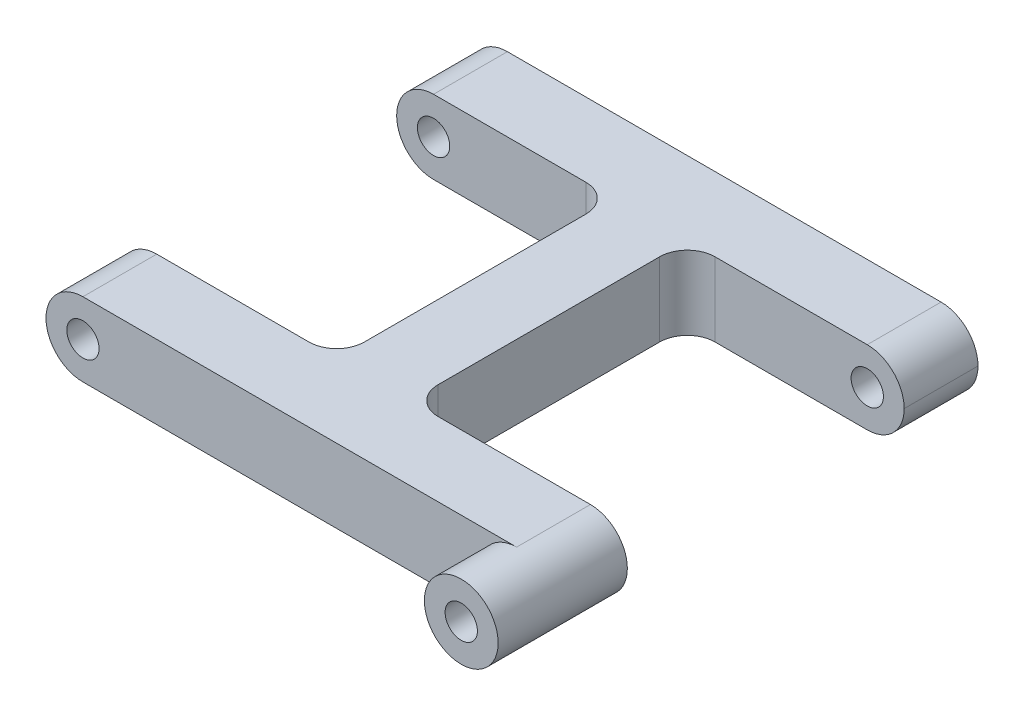
ISO-10303-21;
HEADER;
FILE_DESCRIPTION(('STEP AP214'),'2;1');
FILE_NAME('part.step','',(''),(''),'','','');
FILE_SCHEMA(('AUTOMOTIVE_DESIGN { 1 0 10303 214 1 1 1 1 }'));
ENDSEC;
DATA;
#1=APPLICATION_CONTEXT('core data for automotive mechanical design processes');
#2=APPLICATION_PROTOCOL_DEFINITION('international standard','automotive_design',2000,#1);
#3=PRODUCT_CONTEXT('',#1,'mechanical');
#4=PRODUCT('Part','Part','',(#3));
#5=PRODUCT_RELATED_PRODUCT_CATEGORY('part','',(#4));
#6=PRODUCT_DEFINITION_FORMATION('','',#4);
#7=PRODUCT_DEFINITION_CONTEXT('part definition',#1,'design');
#8=PRODUCT_DEFINITION('design','',#6,#7);
#9=PRODUCT_DEFINITION_SHAPE('','',#8);
#10=(LENGTH_UNIT() NAMED_UNIT(*) SI_UNIT(.MILLI.,.METRE.));
#11=(NAMED_UNIT(*) PLANE_ANGLE_UNIT() SI_UNIT($,.RADIAN.));
#12=(NAMED_UNIT(*) SI_UNIT($,.STERADIAN.) SOLID_ANGLE_UNIT());
#13=UNCERTAINTY_MEASURE_WITH_UNIT(LENGTH_MEASURE(1.E-05),#10,'distance_accuracy_value','');
#14=(GEOMETRIC_REPRESENTATION_CONTEXT(3) GLOBAL_UNCERTAINTY_ASSIGNED_CONTEXT((#13)) GLOBAL_UNIT_ASSIGNED_CONTEXT((#10,
#11,#12)) REPRESENTATION_CONTEXT('',''));
#15=CARTESIAN_POINT('',(0.,0.,0.));
#16=DIRECTION('',(0.,0.,1.));
#17=DIRECTION('',(1.,0.,0.));
#18=AXIS2_PLACEMENT_3D('',#15,#16,#17);
#19=CARTESIAN_POINT('',(23.5,0.,-23.));
#20=DIRECTION('',(0.,0.,1.));
#21=DIRECTION('',(1.,0.,0.));
#22=AXIS2_PLACEMENT_3D('',#19,#20,#21);
#23=CYLINDRICAL_SURFACE('',#22,1.75);
#24=CARTESIAN_POINT('',(23.5,0.,-15.));
#25=DIRECTION('',(0.,0.,-1.));
#26=DIRECTION('',(-1.,0.,0.));
#27=AXIS2_PLACEMENT_3D('',#24,#25,#26);
#28=CIRCLE('',#27,1.75);
#29=CARTESIAN_POINT('',(21.75,0.,-15.));
#30=VERTEX_POINT('',#29);
#31=EDGE_CURVE('E368',#30,#30,#28,.T.);
#32=ORIENTED_EDGE('',*,*,#31,.F.);
#33=EDGE_LOOP('',(#32));
#34=FACE_BOUND('',#33,.T.);
#35=CARTESIAN_POINT('',(23.5,0.,-19.8));
#36=DIRECTION('',(0.,0.,-1.));
#37=DIRECTION('',(-1.,0.,0.));
#38=AXIS2_PLACEMENT_3D('',#35,#36,#37);
#39=CIRCLE('',#38,1.75);
#40=CARTESIAN_POINT('',(21.75,0.,-19.8));
#41=VERTEX_POINT('',#40);
#42=EDGE_CURVE('E41',#41,#41,#39,.F.);
#43=ORIENTED_EDGE('',*,*,#42,.F.);
#44=EDGE_LOOP('',(#43));
#45=FACE_BOUND('',#44,.T.);
#46=ADVANCED_FACE('F37',(#34,#45),#23,.F.);
#47=CARTESIAN_POINT('',(27.5,4.,23.));
#48=DIRECTION('',(0.,0.,-1.));
#49=DIRECTION('',(-1.,0.,0.));
#50=AXIS2_PLACEMENT_3D('',#47,#48,#49);
#51=PLANE('',#50);
#52=CARTESIAN_POINT('',(-23.5,1.3965925355343E-13,23.));
#53=DIRECTION('',(0.,0.,1.));
#54=DIRECTION('',(1.,0.,0.));
#55=AXIS2_PLACEMENT_3D('',#52,#53,#54);
#56=CIRCLE('',#55,1.74999999999996);
#57=CARTESIAN_POINT('',(-21.75,1.3965925355343E-13,23.));
#58=VERTEX_POINT('',#57);
#59=EDGE_CURVE('E377',#58,#58,#56,.T.);
#60=ORIENTED_EDGE('',*,*,#59,.F.);
#61=EDGE_LOOP('',(#60));
#62=FACE_BOUND('',#61,.T.);
#63=CARTESIAN_POINT('',(23.5,0.,23.));
#64=DIRECTION('',(0.,0.,1.));
#65=DIRECTION('',(1.,0.,0.));
#66=AXIS2_PLACEMENT_3D('',#63,#64,#65);
#67=CIRCLE('',#66,4.);
#68=CARTESIAN_POINT('',(23.5,4.,23.));
#69=VERTEX_POINT('',#68);
#70=CARTESIAN_POINT('',(23.5,-4.,23.));
#71=VERTEX_POINT('',#70);
#72=EDGE_CURVE('E11',#69,#71,#67,.T.);
#73=ORIENTED_EDGE('',*,*,#72,.F.);
#74=DIRECTION('',(1.,0.,0.));
#75=VECTOR('',#74,1.);
#76=CARTESIAN_POINT('',(27.5,4.,23.));
#77=LINE('',#76,#75);
#78=CARTESIAN_POINT('',(-23.5,4.,23.));
#79=VERTEX_POINT('',#78);
#80=EDGE_CURVE('E354',#79,#69,#77,.T.);
#81=ORIENTED_EDGE('',*,*,#80,.F.);
#82=CARTESIAN_POINT('',(-23.5,0.,23.));
#83=DIRECTION('',(0.,0.,-1.));
#84=DIRECTION('',(-1.,0.,0.));
#85=AXIS2_PLACEMENT_3D('',#82,#83,#84);
#86=CIRCLE('',#85,4.);
#87=CARTESIAN_POINT('',(-27.5,0.,23.));
#88=VERTEX_POINT('',#87);
#89=EDGE_CURVE('E307',#79,#88,#86,.F.);
#90=ORIENTED_EDGE('',*,*,#89,.T.);
#91=CARTESIAN_POINT('',(-23.5,0.,23.));
#92=DIRECTION('',(0.,0.,-1.));
#93=DIRECTION('',(-1.,0.,0.));
#94=AXIS2_PLACEMENT_3D('',#91,#92,#93);
#95=CIRCLE('',#94,4.);
#96=CARTESIAN_POINT('',(-23.5,-4.,23.));
#97=VERTEX_POINT('',#96);
#98=EDGE_CURVE('E309',#88,#97,#95,.F.);
#99=ORIENTED_EDGE('',*,*,#98,.T.);
#100=DIRECTION('',(1.,0.,0.));
#101=VECTOR('',#100,1.);
#102=CARTESIAN_POINT('',(27.5,-4.,23.));
#103=LINE('',#102,#101);
#104=EDGE_CURVE('E268',#97,#71,#103,.T.);
#105=ORIENTED_EDGE('',*,*,#104,.T.);
#106=EDGE_LOOP('',(#73,#81,#90,#99,#105));
#107=FACE_BOUND('',#106,.T.);
#108=ADVANCED_FACE('F347',(#62,#107),#51,.F.);
#109=CARTESIAN_POINT('',(-4.,4.,-15.));
#110=DIRECTION('',(0.,0.,-1.));
#111=DIRECTION('',(-1.,0.,0.));
#112=AXIS2_PLACEMENT_3D('',#109,#110,#111);
#113=PLANE('',#112);
#114=CARTESIAN_POINT('',(-23.5,1.3965925355343E-13,-15.));
#115=DIRECTION('',(0.,0.,-1.));
#116=DIRECTION('',(-1.,0.,0.));
#117=AXIS2_PLACEMENT_3D('',#114,#115,#116);
#118=CIRCLE('',#117,1.74999999999996);
#119=CARTESIAN_POINT('',(-25.25,1.3965925355343E-13,-15.));
#120=VERTEX_POINT('',#119);
#121=EDGE_CURVE('E371',#120,#120,#118,.T.);
#122=ORIENTED_EDGE('',*,*,#121,.T.);
#123=EDGE_LOOP('',(#122));
#124=FACE_BOUND('',#123,.T.);
#125=DIRECTION('',(1.,0.,0.));
#126=VECTOR('',#125,1.);
#127=CARTESIAN_POINT('',(-4.,-4.,-15.));
#128=LINE('',#127,#126);
#129=CARTESIAN_POINT('',(-23.5,-4.,-15.));
#130=VERTEX_POINT('',#129);
#131=CARTESIAN_POINT('',(-7.,-4.,-15.));
#132=VERTEX_POINT('',#131);
#133=EDGE_CURVE('E259',#130,#132,#128,.T.);
#134=ORIENTED_EDGE('',*,*,#133,.T.);
#135=DIRECTION('',(0.,-1.,0.));
#136=VECTOR('',#135,1.);
#137=CARTESIAN_POINT('',(-7.,4.,-15.));
#138=LINE('',#137,#136);
#139=CARTESIAN_POINT('',(-7.,4.,-15.));
#140=VERTEX_POINT('',#139);
#141=EDGE_CURVE('E203',#132,#140,#138,.F.);
#142=ORIENTED_EDGE('',*,*,#141,.T.);
#143=DIRECTION('',(1.,0.,0.));
#144=VECTOR('',#143,1.);
#145=CARTESIAN_POINT('',(-4.,4.,-15.));
#146=LINE('',#145,#144);
#147=CARTESIAN_POINT('',(-23.5,4.,-15.));
#148=VERTEX_POINT('',#147);
#149=EDGE_CURVE('E277',#148,#140,#146,.T.);
#150=ORIENTED_EDGE('',*,*,#149,.F.);
#151=CARTESIAN_POINT('',(-23.5,0.,-15.));
#152=DIRECTION('',(0.,0.,-1.));
#153=DIRECTION('',(-1.,0.,0.));
#154=AXIS2_PLACEMENT_3D('',#151,#152,#153);
#155=CIRCLE('',#154,4.);
#156=CARTESIAN_POINT('',(-27.5,0.,-15.));
#157=VERTEX_POINT('',#156);
#158=EDGE_CURVE('E253',#148,#157,#155,.F.);
#159=ORIENTED_EDGE('',*,*,#158,.T.);
#160=CARTESIAN_POINT('',(-23.5,0.,-15.));
#161=DIRECTION('',(0.,0.,-1.));
#162=DIRECTION('',(-1.,0.,0.));
#163=AXIS2_PLACEMENT_3D('',#160,#161,#162);
#164=CIRCLE('',#163,4.);
#165=EDGE_CURVE('E279',#157,#130,#164,.F.);
#166=ORIENTED_EDGE('',*,*,#165,.T.);
#167=EDGE_LOOP('',(#134,#142,#150,#159,#166));
#168=FACE_BOUND('',#167,.T.);
#169=ADVANCED_FACE('F405',(#124,#168),#113,.F.);
#170=CARTESIAN_POINT('',(-4.,4.,15.));
#171=DIRECTION('',(1.,0.,0.));
#172=DIRECTION('',(0.,0.,-1.));
#173=AXIS2_PLACEMENT_3D('',#170,#171,#172);
#174=PLANE('',#173);
#175=DIRECTION('',(0.,0.,1.));
#176=VECTOR('',#175,1.);
#177=CARTESIAN_POINT('',(-4.,-4.,15.));
#178=LINE('',#177,#176);
#179=CARTESIAN_POINT('',(-4.,-4.,-12.));
#180=VERTEX_POINT('',#179);
#181=CARTESIAN_POINT('',(-4.,-4.,12.));
#182=VERTEX_POINT('',#181);
#183=EDGE_CURVE('E262',#180,#182,#178,.T.);
#184=ORIENTED_EDGE('',*,*,#183,.T.);
#185=DIRECTION('',(0.,-1.,0.));
#186=VECTOR('',#185,1.);
#187=CARTESIAN_POINT('',(-4.,4.,12.));
#188=LINE('',#187,#186);
#189=CARTESIAN_POINT('',(-4.,4.,12.));
#190=VERTEX_POINT('',#189);
#191=EDGE_CURVE('E201',#182,#190,#188,.F.);
#192=ORIENTED_EDGE('',*,*,#191,.T.);
#193=DIRECTION('',(0.,0.,1.));
#194=VECTOR('',#193,1.);
#195=CARTESIAN_POINT('',(-4.,4.,15.));
#196=LINE('',#195,#194);
#197=CARTESIAN_POINT('',(-4.,4.,-12.));
#198=VERTEX_POINT('',#197);
#199=EDGE_CURVE('E361',#198,#190,#196,.T.);
#200=ORIENTED_EDGE('',*,*,#199,.F.);
#201=DIRECTION('',(0.,-1.,0.));
#202=VECTOR('',#201,1.);
#203=CARTESIAN_POINT('',(-4.,-4.,-12.));
#204=LINE('',#203,#202);
#205=EDGE_CURVE('E198',#198,#180,#204,.T.);
#206=ORIENTED_EDGE('',*,*,#205,.T.);
#207=EDGE_LOOP('',(#184,#192,#200,#206));
#208=FACE_BOUND('',#207,.T.);
#209=ADVANCED_FACE('F477',(#208),#174,.F.);
#210=CARTESIAN_POINT('',(-27.5,4.,15.));
#211=DIRECTION('',(0.,0.,1.));
#212=DIRECTION('',(1.,0.,0.));
#213=AXIS2_PLACEMENT_3D('',#210,#211,#212);
#214=PLANE('',#213);
#215=CARTESIAN_POINT('',(-23.5,1.3965925355343E-13,15.));
#216=DIRECTION('',(0.,0.,1.));
#217=DIRECTION('',(1.,0.,0.));
#218=AXIS2_PLACEMENT_3D('',#215,#216,#217);
#219=CIRCLE('',#218,1.74999999999996);
#220=CARTESIAN_POINT('',(-21.75,1.3965925355343E-13,15.));
#221=VERTEX_POINT('',#220);
#222=EDGE_CURVE('E374',#221,#221,#219,.T.);
#223=ORIENTED_EDGE('',*,*,#222,.T.);
#224=EDGE_LOOP('',(#223));
#225=FACE_BOUND('',#224,.T.);
#226=DIRECTION('',(-1.,0.,0.));
#227=VECTOR('',#226,1.);
#228=CARTESIAN_POINT('',(-27.5,4.,15.));
#229=LINE('',#228,#227);
#230=CARTESIAN_POINT('',(-7.,4.,15.));
#231=VERTEX_POINT('',#230);
#232=CARTESIAN_POINT('',(-23.5,4.,15.));
#233=VERTEX_POINT('',#232);
#234=EDGE_CURVE('E340',#231,#233,#229,.T.);
#235=ORIENTED_EDGE('',*,*,#234,.F.);
#236=DIRECTION('',(0.,-1.,0.));
#237=VECTOR('',#236,1.);
#238=CARTESIAN_POINT('',(-7.,-4.,15.));
#239=LINE('',#238,#237);
#240=CARTESIAN_POINT('',(-7.,-4.,15.));
#241=VERTEX_POINT('',#240);
#242=EDGE_CURVE('E195',#231,#241,#239,.T.);
#243=ORIENTED_EDGE('',*,*,#242,.T.);
#244=DIRECTION('',(-1.,0.,0.));
#245=VECTOR('',#244,1.);
#246=CARTESIAN_POINT('',(-27.5,-4.,15.));
#247=LINE('',#246,#245);
#248=CARTESIAN_POINT('',(-23.5,-4.,15.));
#249=VERTEX_POINT('',#248);
#250=EDGE_CURVE('E266',#241,#249,#247,.T.);
#251=ORIENTED_EDGE('',*,*,#250,.T.);
#252=CARTESIAN_POINT('',(-23.5,0.,15.));
#253=DIRECTION('',(0.,0.,1.));
#254=DIRECTION('',(1.,0.,0.));
#255=AXIS2_PLACEMENT_3D('',#252,#253,#254);
#256=CIRCLE('',#255,4.);
#257=CARTESIAN_POINT('',(-27.5,0.,15.));
#258=VERTEX_POINT('',#257);
#259=EDGE_CURVE('E314',#249,#258,#256,.F.);
#260=ORIENTED_EDGE('',*,*,#259,.T.);
#261=CARTESIAN_POINT('',(-23.5,0.,15.));
#262=DIRECTION('',(0.,0.,1.));
#263=DIRECTION('',(1.,0.,0.));
#264=AXIS2_PLACEMENT_3D('',#261,#262,#263);
#265=CIRCLE('',#264,4.);
#266=EDGE_CURVE('E311',#258,#233,#265,.F.);
#267=ORIENTED_EDGE('',*,*,#266,.T.);
#268=EDGE_LOOP('',(#235,#243,#251,#260,#267));
#269=FACE_BOUND('',#268,.T.);
#270=ADVANCED_FACE('F339',(#225,#269),#214,.F.);
#271=CARTESIAN_POINT('',(27.5,4.,15.));
#272=DIRECTION('',(0.,0.,1.));
#273=DIRECTION('',(1.,0.,0.));
#274=AXIS2_PLACEMENT_3D('',#271,#272,#273);
#275=PLANE('',#274);
#276=CARTESIAN_POINT('',(23.5,0.,15.));
#277=DIRECTION('',(0.,0.,1.));
#278=DIRECTION('',(1.,0.,0.));
#279=AXIS2_PLACEMENT_3D('',#276,#277,#278);
#280=CIRCLE('',#279,1.75);
#281=CARTESIAN_POINT('',(25.25,0.,15.));
#282=VERTEX_POINT('',#281);
#283=EDGE_CURVE('E263',#282,#282,#280,.T.);
#284=ORIENTED_EDGE('',*,*,#283,.T.);
#285=EDGE_LOOP('',(#284));
#286=FACE_BOUND('',#285,.T.);
#287=DIRECTION('',(-1.,0.,0.));
#288=VECTOR('',#287,1.);
#289=CARTESIAN_POINT('',(27.5,-4.,15.));
#290=LINE('',#289,#288);
#291=CARTESIAN_POINT('',(23.5,-4.,15.));
#292=VERTEX_POINT('',#291);
#293=CARTESIAN_POINT('',(7.00000000000001,-4.,15.));
#294=VERTEX_POINT('',#293);
#295=EDGE_CURVE('E239',#292,#294,#290,.T.);
#296=ORIENTED_EDGE('',*,*,#295,.T.);
#297=DIRECTION('',(0.,-1.,0.));
#298=VECTOR('',#297,1.);
#299=CARTESIAN_POINT('',(7.,4.,15.));
#300=LINE('',#299,#298);
#301=CARTESIAN_POINT('',(7.00000000000001,4.,15.));
#302=VERTEX_POINT('',#301);
#303=EDGE_CURVE('E210',#294,#302,#300,.F.);
#304=ORIENTED_EDGE('',*,*,#303,.T.);
#305=DIRECTION('',(-1.,0.,0.));
#306=VECTOR('',#305,1.);
#307=CARTESIAN_POINT('',(27.5,4.,15.));
#308=LINE('',#307,#306);
#309=CARTESIAN_POINT('',(23.5,4.,15.));
#310=VERTEX_POINT('',#309);
#311=EDGE_CURVE('E255',#310,#302,#308,.T.);
#312=ORIENTED_EDGE('',*,*,#311,.F.);
#313=CARTESIAN_POINT('',(23.5,0.,15.));
#314=DIRECTION('',(0.,0.,1.));
#315=DIRECTION('',(1.,0.,0.));
#316=AXIS2_PLACEMENT_3D('',#313,#314,#315);
#317=CIRCLE('',#316,4.);
#318=CARTESIAN_POINT('',(27.5,0.,15.));
#319=VERTEX_POINT('',#318);
#320=EDGE_CURVE('E319',#310,#319,#317,.F.);
#321=ORIENTED_EDGE('',*,*,#320,.T.);
#322=CARTESIAN_POINT('',(23.5,0.,15.));
#323=DIRECTION('',(0.,0.,1.));
#324=DIRECTION('',(1.,0.,0.));
#325=AXIS2_PLACEMENT_3D('',#322,#323,#324);
#326=CIRCLE('',#325,4.);
#327=EDGE_CURVE('E183',#319,#292,#326,.F.);
#328=ORIENTED_EDGE('',*,*,#327,.T.);
#329=EDGE_LOOP('',(#296,#304,#312,#321,#328));
#330=FACE_BOUND('',#329,.T.);
#331=ADVANCED_FACE('F356',(#286,#330),#275,.F.);
#332=CARTESIAN_POINT('',(4.,4.,15.));
#333=DIRECTION('',(-1.,0.,0.));
#334=DIRECTION('',(0.,0.,1.));
#335=AXIS2_PLACEMENT_3D('',#332,#333,#334);
#336=PLANE('',#335);
#337=DIRECTION('',(0.,0.,-1.));
#338=VECTOR('',#337,1.);
#339=CARTESIAN_POINT('',(4.,4.,15.));
#340=LINE('',#339,#338);
#341=CARTESIAN_POINT('',(4.,4.,12.));
#342=VERTEX_POINT('',#341);
#343=CARTESIAN_POINT('',(4.,4.,-12.));
#344=VERTEX_POINT('',#343);
#345=EDGE_CURVE('E250',#342,#344,#340,.T.);
#346=ORIENTED_EDGE('',*,*,#345,.F.);
#347=DIRECTION('',(0.,-1.,0.));
#348=VECTOR('',#347,1.);
#349=CARTESIAN_POINT('',(4.,-4.,12.));
#350=LINE('',#349,#348);
#351=CARTESIAN_POINT('',(4.,-4.,12.));
#352=VERTEX_POINT('',#351);
#353=EDGE_CURVE('E207',#342,#352,#350,.T.);
#354=ORIENTED_EDGE('',*,*,#353,.T.);
#355=DIRECTION('',(0.,0.,-1.));
#356=VECTOR('',#355,1.);
#357=CARTESIAN_POINT('',(4.,-4.,15.));
#358=LINE('',#357,#356);
#359=CARTESIAN_POINT('',(4.,-4.,-12.));
#360=VERTEX_POINT('',#359);
#361=EDGE_CURVE('E232',#352,#360,#358,.T.);
#362=ORIENTED_EDGE('',*,*,#361,.T.);
#363=DIRECTION('',(0.,-1.,0.));
#364=VECTOR('',#363,1.);
#365=CARTESIAN_POINT('',(4.,4.,-12.));
#366=LINE('',#365,#364);
#367=EDGE_CURVE('E205',#360,#344,#366,.F.);
#368=ORIENTED_EDGE('',*,*,#367,.T.);
#369=EDGE_LOOP('',(#346,#354,#362,#368));
#370=FACE_BOUND('',#369,.T.);
#371=ADVANCED_FACE('F237',(#370),#336,.F.);
#372=CARTESIAN_POINT('',(4.,4.,-15.));
#373=DIRECTION('',(0.,0.,-1.));
#374=DIRECTION('',(-1.,0.,0.));
#375=AXIS2_PLACEMENT_3D('',#372,#373,#374);
#376=PLANE('',#375);
#377=ORIENTED_EDGE('',*,*,#31,.T.);
#378=EDGE_LOOP('',(#377));
#379=FACE_BOUND('',#378,.T.);
#380=DIRECTION('',(1.,0.,0.));
#381=VECTOR('',#380,1.);
#382=CARTESIAN_POINT('',(4.,4.,-15.));
#383=LINE('',#382,#381);
#384=CARTESIAN_POINT('',(7.,4.,-15.));
#385=VERTEX_POINT('',#384);
#386=CARTESIAN_POINT('',(23.5,4.,-15.));
#387=VERTEX_POINT('',#386);
#388=EDGE_CURVE('E245',#385,#387,#383,.T.);
#389=ORIENTED_EDGE('',*,*,#388,.F.);
#390=DIRECTION('',(0.,-1.,0.));
#391=VECTOR('',#390,1.);
#392=CARTESIAN_POINT('',(7.,-4.,-15.));
#393=LINE('',#392,#391);
#394=CARTESIAN_POINT('',(7.,-4.,-15.));
#395=VERTEX_POINT('',#394);
#396=EDGE_CURVE('E212',#385,#395,#393,.T.);
#397=ORIENTED_EDGE('',*,*,#396,.T.);
#398=DIRECTION('',(1.,0.,0.));
#399=VECTOR('',#398,1.);
#400=CARTESIAN_POINT('',(4.,-4.,-15.));
#401=LINE('',#400,#399);
#402=CARTESIAN_POINT('',(23.5,-4.,-15.));
#403=VERTEX_POINT('',#402);
#404=EDGE_CURVE('E234',#395,#403,#401,.T.);
#405=ORIENTED_EDGE('',*,*,#404,.T.);
#406=CARTESIAN_POINT('',(23.5,0.,-15.));
#407=DIRECTION('',(0.,0.,-1.));
#408=DIRECTION('',(-1.,0.,0.));
#409=AXIS2_PLACEMENT_3D('',#406,#407,#408);
#410=CIRCLE('',#409,4.);
#411=CARTESIAN_POINT('',(27.5,0.,-15.));
#412=VERTEX_POINT('',#411);
#413=EDGE_CURVE('E317',#403,#412,#410,.F.);
#414=ORIENTED_EDGE('',*,*,#413,.T.);
#415=CARTESIAN_POINT('',(23.5,0.,-15.));
#416=DIRECTION('',(0.,0.,-1.));
#417=DIRECTION('',(-1.,0.,0.));
#418=AXIS2_PLACEMENT_3D('',#415,#416,#417);
#419=CIRCLE('',#418,4.);
#420=EDGE_CURVE('E247',#412,#387,#419,.F.);
#421=ORIENTED_EDGE('',*,*,#420,.T.);
#422=EDGE_LOOP('',(#389,#397,#405,#414,#421));
#423=FACE_BOUND('',#422,.T.);
#424=ADVANCED_FACE('F242',(#379,#423),#376,.F.);
#425=CARTESIAN_POINT('',(27.5,4.,-23.));
#426=DIRECTION('',(0.,0.,1.));
#427=DIRECTION('',(1.,0.,0.));
#428=AXIS2_PLACEMENT_3D('',#425,#426,#427);
#429=PLANE('',#428);
#430=CARTESIAN_POINT('',(23.5,0.,-23.));
#431=DIRECTION('',(0.,0.,-1.));
#432=DIRECTION('',(-1.,0.,0.));
#433=AXIS2_PLACEMENT_3D('',#430,#431,#432);
#434=CIRCLE('',#433,3.1);
#435=CARTESIAN_POINT('',(20.4,0.,-23.));
#436=VERTEX_POINT('',#435);
#437=EDGE_CURVE('E384',#436,#436,#434,.T.);
#438=ORIENTED_EDGE('',*,*,#437,.F.);
#439=EDGE_LOOP('',(#438));
#440=FACE_BOUND('',#439,.T.);
#441=CARTESIAN_POINT('',(-23.5,1.3965925355343E-13,-23.));
#442=DIRECTION('',(0.,0.,1.));
#443=DIRECTION('',(1.,0.,0.));
#444=AXIS2_PLACEMENT_3D('',#441,#442,#443);
#445=CIRCLE('',#444,1.74999999999996);
#446=CARTESIAN_POINT('',(-21.75,1.3965925355343E-13,-23.));
#447=VERTEX_POINT('',#446);
#448=EDGE_CURVE('E324',#447,#447,#445,.T.);
#449=ORIENTED_EDGE('',*,*,#448,.T.);
#450=EDGE_LOOP('',(#449));
#451=FACE_BOUND('',#450,.T.);
#452=DIRECTION('',(-1.,0.,0.));
#453=VECTOR('',#452,1.);
#454=CARTESIAN_POINT('',(27.5,-4.,-23.));
#455=LINE('',#454,#453);
#456=CARTESIAN_POINT('',(23.5,-4.,-23.));
#457=VERTEX_POINT('',#456);
#458=CARTESIAN_POINT('',(-23.5,-4.,-23.));
#459=VERTEX_POINT('',#458);
#460=EDGE_CURVE('E274',#457,#459,#455,.T.);
#461=ORIENTED_EDGE('',*,*,#460,.T.);
#462=CARTESIAN_POINT('',(-23.5,0.,-23.));
#463=DIRECTION('',(0.,0.,1.));
#464=DIRECTION('',(1.,0.,0.));
#465=AXIS2_PLACEMENT_3D('',#462,#463,#464);
#466=CIRCLE('',#465,4.);
#467=CARTESIAN_POINT('',(-27.5,0.,-23.));
#468=VERTEX_POINT('',#467);
#469=EDGE_CURVE('E297',#459,#468,#466,.F.);
#470=ORIENTED_EDGE('',*,*,#469,.T.);
#471=CARTESIAN_POINT('',(-23.5,0.,-23.));
#472=DIRECTION('',(0.,0.,1.));
#473=DIRECTION('',(1.,0.,0.));
#474=AXIS2_PLACEMENT_3D('',#471,#472,#473);
#475=CIRCLE('',#474,4.);
#476=CARTESIAN_POINT('',(-23.5,4.,-23.));
#477=VERTEX_POINT('',#476);
#478=EDGE_CURVE('E295',#468,#477,#475,.F.);
#479=ORIENTED_EDGE('',*,*,#478,.T.);
#480=DIRECTION('',(-1.,0.,0.));
#481=VECTOR('',#480,1.);
#482=CARTESIAN_POINT('',(27.5,4.,-23.));
#483=LINE('',#482,#481);
#484=CARTESIAN_POINT('',(23.5,4.,-23.));
#485=VERTEX_POINT('',#484);
#486=EDGE_CURVE('E249',#485,#477,#483,.T.);
#487=ORIENTED_EDGE('',*,*,#486,.F.);
#488=CARTESIAN_POINT('',(23.5,0.,-23.));
#489=DIRECTION('',(0.,0.,1.));
#490=DIRECTION('',(1.,0.,0.));
#491=AXIS2_PLACEMENT_3D('',#488,#489,#490);
#492=CIRCLE('',#491,4.);
#493=CARTESIAN_POINT('',(27.5,0.,-23.));
#494=VERTEX_POINT('',#493);
#495=EDGE_CURVE('E291',#485,#494,#492,.F.);
#496=ORIENTED_EDGE('',*,*,#495,.T.);
#497=CARTESIAN_POINT('',(23.5,0.,-23.));
#498=DIRECTION('',(0.,0.,1.));
#499=DIRECTION('',(1.,0.,0.));
#500=AXIS2_PLACEMENT_3D('',#497,#498,#499);
#501=CIRCLE('',#500,4.);
#502=EDGE_CURVE('E293',#494,#457,#501,.F.);
#503=ORIENTED_EDGE('',*,*,#502,.T.);
#504=EDGE_LOOP('',(#461,#470,#479,#487,#496,#503));
#505=FACE_BOUND('',#504,.T.);
#506=ADVANCED_FACE('F444',(#440,#451,#505),#429,.F.);
#507=CARTESIAN_POINT('',(0.,4.,0.));
#508=DIRECTION('',(0.,1.,0.));
#509=DIRECTION('',(0.,0.,1.));
#510=AXIS2_PLACEMENT_3D('',#507,#508,#509);
#511=PLANE('',#510);
#512=ORIENTED_EDGE('',*,*,#486,.T.);
#513=DIRECTION('',(0.,0.,1.));
#514=VECTOR('',#513,1.);
#515=CARTESIAN_POINT('',(-23.5,4.,-15.));
#516=LINE('',#515,#514);
#517=EDGE_CURVE('E305',#477,#148,#516,.T.);
#518=ORIENTED_EDGE('',*,*,#517,.T.);
#519=ORIENTED_EDGE('',*,*,#149,.T.);
#520=CARTESIAN_POINT('',(-7.,4.,-12.));
#521=DIRECTION('',(0.,1.,0.));
#522=DIRECTION('',(0.,0.,1.));
#523=AXIS2_PLACEMENT_3D('',#520,#521,#522);
#524=CIRCLE('',#523,3.);
#525=EDGE_CURVE('E220',#140,#198,#524,.F.);
#526=ORIENTED_EDGE('',*,*,#525,.T.);
#527=ORIENTED_EDGE('',*,*,#199,.T.);
#528=CARTESIAN_POINT('',(-7.,4.,12.));
#529=DIRECTION('',(0.,1.,0.));
#530=DIRECTION('',(0.,0.,1.));
#531=AXIS2_PLACEMENT_3D('',#528,#529,#530);
#532=CIRCLE('',#531,3.);
#533=EDGE_CURVE('E216',#190,#231,#532,.F.);
#534=ORIENTED_EDGE('',*,*,#533,.T.);
#535=ORIENTED_EDGE('',*,*,#234,.T.);
#536=DIRECTION('',(0.,0.,1.));
#537=VECTOR('',#536,1.);
#538=CARTESIAN_POINT('',(-23.5,4.,23.));
#539=LINE('',#538,#537);
#540=EDGE_CURVE('E303',#233,#79,#539,.T.);
#541=ORIENTED_EDGE('',*,*,#540,.T.);
#542=ORIENTED_EDGE('',*,*,#80,.T.);
#543=DIRECTION('',(0.,0.,-1.));
#544=VECTOR('',#543,1.);
#545=CARTESIAN_POINT('',(23.5,4.,15.));
#546=LINE('',#545,#544);
#547=EDGE_CURVE('E299',#69,#310,#546,.T.);
#548=ORIENTED_EDGE('',*,*,#547,.T.);
#549=ORIENTED_EDGE('',*,*,#311,.T.);
#550=CARTESIAN_POINT('',(7.,4.,12.));
#551=DIRECTION('',(0.,1.,0.));
#552=DIRECTION('',(0.,0.,1.));
#553=AXIS2_PLACEMENT_3D('',#550,#551,#552);
#554=CIRCLE('',#553,3.);
#555=EDGE_CURVE('E224',#302,#342,#554,.F.);
#556=ORIENTED_EDGE('',*,*,#555,.T.);
#557=ORIENTED_EDGE('',*,*,#345,.T.);
#558=CARTESIAN_POINT('',(7.,4.,-12.));
#559=DIRECTION('',(0.,1.,0.));
#560=DIRECTION('',(0.,0.,1.));
#561=AXIS2_PLACEMENT_3D('',#558,#559,#560);
#562=CIRCLE('',#561,3.);
#563=EDGE_CURVE('E46',#344,#385,#562,.F.);
#564=ORIENTED_EDGE('',*,*,#563,.T.);
#565=ORIENTED_EDGE('',*,*,#388,.T.);
#566=DIRECTION('',(0.,0.,-1.));
#567=VECTOR('',#566,1.);
#568=CARTESIAN_POINT('',(23.5,4.,-23.));
#569=LINE('',#568,#567);
#570=EDGE_CURVE('E301',#387,#485,#569,.T.);
#571=ORIENTED_EDGE('',*,*,#570,.T.);
#572=EDGE_LOOP('',(#512,#518,#519,#526,#527,#534,#535,#541,#542,#548,#549,#556,#557,#564,#565,#571));
#573=FACE_BOUND('',#572,.T.);
#574=ADVANCED_FACE('F352',(#573),#511,.T.);
#575=CARTESIAN_POINT('',(0.,-4.,0.));
#576=DIRECTION('',(0.,1.,0.));
#577=DIRECTION('',(0.,0.,1.));
#578=AXIS2_PLACEMENT_3D('',#575,#576,#577);
#579=PLANE('',#578);
#580=ORIENTED_EDGE('',*,*,#133,.F.);
#581=DIRECTION('',(0.,0.,1.));
#582=VECTOR('',#581,1.);
#583=CARTESIAN_POINT('',(-23.5,-4.,0.));
#584=LINE('',#583,#582);
#585=EDGE_CURVE('E288',#130,#459,#584,.F.);
#586=ORIENTED_EDGE('',*,*,#585,.T.);
#587=ORIENTED_EDGE('',*,*,#460,.F.);
#588=DIRECTION('',(0.,0.,-1.));
#589=VECTOR('',#588,1.);
#590=CARTESIAN_POINT('',(23.5,-4.,0.));
#591=LINE('',#590,#589);
#592=EDGE_CURVE('E283',#457,#403,#591,.F.);
#593=ORIENTED_EDGE('',*,*,#592,.T.);
#594=ORIENTED_EDGE('',*,*,#404,.F.);
#595=CARTESIAN_POINT('',(7.,-4.,-12.));
#596=DIRECTION('',(0.,1.,0.));
#597=DIRECTION('',(0.,0.,1.));
#598=AXIS2_PLACEMENT_3D('',#595,#596,#597);
#599=CIRCLE('',#598,3.);
#600=EDGE_CURVE('E61',#395,#360,#599,.T.);
#601=ORIENTED_EDGE('',*,*,#600,.T.);
#602=ORIENTED_EDGE('',*,*,#361,.F.);
#603=CARTESIAN_POINT('',(7.,-4.,12.));
#604=DIRECTION('',(0.,1.,0.));
#605=DIRECTION('',(0.,0.,1.));
#606=AXIS2_PLACEMENT_3D('',#603,#604,#605);
#607=CIRCLE('',#606,3.);
#608=EDGE_CURVE('E222',#352,#294,#607,.T.);
#609=ORIENTED_EDGE('',*,*,#608,.T.);
#610=ORIENTED_EDGE('',*,*,#295,.F.);
#611=DIRECTION('',(0.,0.,-1.));
#612=VECTOR('',#611,1.);
#613=CARTESIAN_POINT('',(23.5,-4.,0.));
#614=LINE('',#613,#612);
#615=EDGE_CURVE('E281',#292,#71,#614,.F.);
#616=ORIENTED_EDGE('',*,*,#615,.T.);
#617=ORIENTED_EDGE('',*,*,#104,.F.);
#618=DIRECTION('',(0.,0.,1.));
#619=VECTOR('',#618,1.);
#620=CARTESIAN_POINT('',(-23.5,-4.,0.));
#621=LINE('',#620,#619);
#622=EDGE_CURVE('E285',#97,#249,#621,.F.);
#623=ORIENTED_EDGE('',*,*,#622,.T.);
#624=ORIENTED_EDGE('',*,*,#250,.F.);
#625=CARTESIAN_POINT('',(-7.,-4.,12.));
#626=DIRECTION('',(0.,1.,0.));
#627=DIRECTION('',(0.,0.,1.));
#628=AXIS2_PLACEMENT_3D('',#625,#626,#627);
#629=CIRCLE('',#628,3.);
#630=EDGE_CURVE('E214',#241,#182,#629,.T.);
#631=ORIENTED_EDGE('',*,*,#630,.T.);
#632=ORIENTED_EDGE('',*,*,#183,.F.);
#633=CARTESIAN_POINT('',(-7.,-4.,-12.));
#634=DIRECTION('',(0.,1.,0.));
#635=DIRECTION('',(0.,0.,1.));
#636=AXIS2_PLACEMENT_3D('',#633,#634,#635);
#637=CIRCLE('',#636,3.);
#638=EDGE_CURVE('E218',#180,#132,#637,.T.);
#639=ORIENTED_EDGE('',*,*,#638,.T.);
#640=EDGE_LOOP('',(#580,#586,#587,#593,#594,#601,#602,#609,#610,#616,#617,#623,#624,#631,#632,#639));
#641=FACE_BOUND('',#640,.T.);
#642=ADVANCED_FACE('F231',(#641),#579,.F.);
#643=CARTESIAN_POINT('',(-23.5,1.3965925355343E-13,-23.));
#644=DIRECTION('',(0.,0.,1.));
#645=DIRECTION('',(1.,0.,0.));
#646=AXIS2_PLACEMENT_3D('',#643,#644,#645);
#647=CYLINDRICAL_SURFACE('',#646,1.74999999999996);
#648=ORIENTED_EDGE('',*,*,#448,.F.);
#649=EDGE_LOOP('',(#648));
#650=FACE_BOUND('',#649,.T.);
#651=ORIENTED_EDGE('',*,*,#121,.F.);
#652=EDGE_LOOP('',(#651));
#653=FACE_BOUND('',#652,.T.);
#654=ADVANCED_FACE('F413',(#650,#653),#647,.F.);
#655=ORIENTED_EDGE('',*,*,#283,.F.);
#656=EDGE_LOOP('',(#655));
#657=FACE_BOUND('',#656,.T.);
#658=CARTESIAN_POINT('',(23.5,0.,29.));
#659=DIRECTION('',(0.,0.,1.));
#660=DIRECTION('',(1.,0.,0.));
#661=AXIS2_PLACEMENT_3D('',#658,#659,#660);
#662=CIRCLE('',#661,1.75);
#663=CARTESIAN_POINT('',(25.25,0.,29.));
#664=VERTEX_POINT('',#663);
#665=EDGE_CURVE('E191',#664,#664,#662,.T.);
#666=ORIENTED_EDGE('',*,*,#665,.T.);
#667=EDGE_LOOP('',(#666));
#668=FACE_BOUND('',#667,.T.);
#669=ADVANCED_FACE('F399',(#657,#668),#23,.F.);
#670=ORIENTED_EDGE('',*,*,#59,.T.);
#671=EDGE_LOOP('',(#670));
#672=FACE_BOUND('',#671,.T.);
#673=ORIENTED_EDGE('',*,*,#222,.F.);
#674=EDGE_LOOP('',(#673));
#675=FACE_BOUND('',#674,.T.);
#676=ADVANCED_FACE('F412',(#672,#675),#647,.F.);
#677=CARTESIAN_POINT('',(-23.5,0.,0.));
#678=DIRECTION('',(0.,0.,-1.));
#679=DIRECTION('',(-1.,0.,0.));
#680=AXIS2_PLACEMENT_3D('',#677,#678,#679);
#681=CYLINDRICAL_SURFACE('',#680,4.);
#682=ORIENTED_EDGE('',*,*,#517,.F.);
#683=ORIENTED_EDGE('',*,*,#478,.F.);
#684=DIRECTION('',(0.,0.,1.));
#685=VECTOR('',#684,1.);
#686=CARTESIAN_POINT('',(-27.5,0.,-23.));
#687=LINE('',#686,#685);
#688=EDGE_CURVE('E322',#157,#468,#687,.F.);
#689=ORIENTED_EDGE('',*,*,#688,.F.);
#690=ORIENTED_EDGE('',*,*,#158,.F.);
#691=EDGE_LOOP('',(#682,#683,#689,#690));
#692=FACE_BOUND('',#691,.T.);
#693=ADVANCED_FACE('F419',(#692),#681,.T.);
#694=CARTESIAN_POINT('',(-23.5,0.,-15.));
#695=DIRECTION('',(0.,0.,1.));
#696=DIRECTION('',(1.,0.,0.));
#697=AXIS2_PLACEMENT_3D('',#694,#695,#696);
#698=CYLINDRICAL_SURFACE('',#697,4.);
#699=ORIENTED_EDGE('',*,*,#469,.F.);
#700=ORIENTED_EDGE('',*,*,#585,.F.);
#701=ORIENTED_EDGE('',*,*,#165,.F.);
#702=ORIENTED_EDGE('',*,*,#688,.T.);
#703=EDGE_LOOP('',(#699,#700,#701,#702));
#704=FACE_BOUND('',#703,.T.);
#705=ADVANCED_FACE('F467',(#704),#698,.T.);
#706=CARTESIAN_POINT('',(-23.5,0.,0.));
#707=DIRECTION('',(0.,0.,-1.));
#708=DIRECTION('',(-1.,0.,0.));
#709=AXIS2_PLACEMENT_3D('',#706,#707,#708);
#710=CYLINDRICAL_SURFACE('',#709,4.);
#711=ORIENTED_EDGE('',*,*,#540,.F.);
#712=ORIENTED_EDGE('',*,*,#266,.F.);
#713=DIRECTION('',(0.,0.,1.));
#714=VECTOR('',#713,1.);
#715=CARTESIAN_POINT('',(-27.5,0.,15.));
#716=LINE('',#715,#714);
#717=EDGE_CURVE('E188',#88,#258,#716,.F.);
#718=ORIENTED_EDGE('',*,*,#717,.F.);
#719=ORIENTED_EDGE('',*,*,#89,.F.);
#720=EDGE_LOOP('',(#711,#712,#718,#719));
#721=FACE_BOUND('',#720,.T.);
#722=ADVANCED_FACE('F336',(#721),#710,.T.);
#723=CARTESIAN_POINT('',(-23.5,0.,23.));
#724=DIRECTION('',(0.,0.,1.));
#725=DIRECTION('',(1.,0.,0.));
#726=AXIS2_PLACEMENT_3D('',#723,#724,#725);
#727=CYLINDRICAL_SURFACE('',#726,4.);
#728=ORIENTED_EDGE('',*,*,#259,.F.);
#729=ORIENTED_EDGE('',*,*,#622,.F.);
#730=ORIENTED_EDGE('',*,*,#98,.F.);
#731=ORIENTED_EDGE('',*,*,#717,.T.);
#732=EDGE_LOOP('',(#728,#729,#730,#731));
#733=FACE_BOUND('',#732,.T.);
#734=ADVANCED_FACE('F330',(#733),#727,.T.);
#735=CARTESIAN_POINT('',(23.5,0.,0.));
#736=DIRECTION('',(0.,0.,1.));
#737=DIRECTION('',(1.,0.,0.));
#738=AXIS2_PLACEMENT_3D('',#735,#736,#737);
#739=CYLINDRICAL_SURFACE('',#738,4.);
#740=ORIENTED_EDGE('',*,*,#570,.F.);
#741=ORIENTED_EDGE('',*,*,#420,.F.);
#742=DIRECTION('',(0.,0.,-1.));
#743=VECTOR('',#742,1.);
#744=CARTESIAN_POINT('',(27.5,0.,-15.));
#745=LINE('',#744,#743);
#746=EDGE_CURVE('E184',#494,#412,#745,.F.);
#747=ORIENTED_EDGE('',*,*,#746,.F.);
#748=ORIENTED_EDGE('',*,*,#495,.F.);
#749=EDGE_LOOP('',(#740,#741,#747,#748));
#750=FACE_BOUND('',#749,.T.);
#751=ADVANCED_FACE('F458',(#750),#739,.T.);
#752=CARTESIAN_POINT('',(23.5,0.,-15.));
#753=DIRECTION('',(0.,0.,-1.));
#754=DIRECTION('',(-1.,0.,0.));
#755=AXIS2_PLACEMENT_3D('',#752,#753,#754);
#756=CYLINDRICAL_SURFACE('',#755,4.);
#757=ORIENTED_EDGE('',*,*,#413,.F.);
#758=ORIENTED_EDGE('',*,*,#592,.F.);
#759=ORIENTED_EDGE('',*,*,#502,.F.);
#760=ORIENTED_EDGE('',*,*,#746,.T.);
#761=EDGE_LOOP('',(#757,#758,#759,#760));
#762=FACE_BOUND('',#761,.T.);
#763=ADVANCED_FACE('F455',(#762),#756,.T.);
#764=CARTESIAN_POINT('',(23.5,0.,0.));
#765=DIRECTION('',(0.,0.,1.));
#766=DIRECTION('',(1.,0.,0.));
#767=AXIS2_PLACEMENT_3D('',#764,#765,#766);
#768=CYLINDRICAL_SURFACE('',#767,4.);
#769=ORIENTED_EDGE('',*,*,#547,.F.);
#770=ORIENTED_EDGE('',*,*,#72,.T.);
#771=ORIENTED_EDGE('',*,*,#615,.F.);
#772=ORIENTED_EDGE('',*,*,#327,.F.);
#773=DIRECTION('',(0.,0.,-1.));
#774=VECTOR('',#773,1.);
#775=CARTESIAN_POINT('',(27.5,0.,23.));
#776=LINE('',#775,#774);
#777=CARTESIAN_POINT('',(27.5,0.,23.));
#778=VERTEX_POINT('',#777);
#779=EDGE_CURVE('E177',#319,#778,#776,.F.);
#780=ORIENTED_EDGE('',*,*,#779,.T.);
#781=ORIENTED_EDGE('',*,*,#779,.F.);
#782=ORIENTED_EDGE('',*,*,#320,.F.);
#783=EDGE_LOOP('',(#769,#770,#771,#772,#780,#781,#782));
#784=FACE_BOUND('',#783,.T.);
#785=CARTESIAN_POINT('',(23.5,0.,29.));
#786=DIRECTION('',(0.,0.,1.));
#787=DIRECTION('',(1.,0.,0.));
#788=AXIS2_PLACEMENT_3D('',#785,#786,#787);
#789=CIRCLE('',#788,4.);
#790=CARTESIAN_POINT('',(27.5,0.,29.));
#791=VERTEX_POINT('',#790);
#792=EDGE_CURVE('E185',#791,#791,#789,.T.);
#793=ORIENTED_EDGE('',*,*,#792,.F.);
#794=EDGE_LOOP('',(#793));
#795=FACE_BOUND('',#794,.T.);
#796=ADVANCED_FACE('F179',(#784,#795),#768,.T.);
#797=CARTESIAN_POINT('',(-7.,4.,12.));
#798=DIRECTION('',(0.,1.,0.));
#799=DIRECTION('',(0.,0.,1.));
#800=AXIS2_PLACEMENT_3D('',#797,#798,#799);
#801=CYLINDRICAL_SURFACE('',#800,3.);
#802=ORIENTED_EDGE('',*,*,#533,.F.);
#803=ORIENTED_EDGE('',*,*,#191,.F.);
#804=ORIENTED_EDGE('',*,*,#630,.F.);
#805=ORIENTED_EDGE('',*,*,#242,.F.);
#806=EDGE_LOOP('',(#802,#803,#804,#805));
#807=FACE_BOUND('',#806,.T.);
#808=ADVANCED_FACE('F481',(#807),#801,.F.);
#809=CARTESIAN_POINT('',(-7.,4.,-12.));
#810=DIRECTION('',(0.,1.,0.));
#811=DIRECTION('',(0.,0.,1.));
#812=AXIS2_PLACEMENT_3D('',#809,#810,#811);
#813=CYLINDRICAL_SURFACE('',#812,3.);
#814=ORIENTED_EDGE('',*,*,#525,.F.);
#815=ORIENTED_EDGE('',*,*,#141,.F.);
#816=ORIENTED_EDGE('',*,*,#638,.F.);
#817=ORIENTED_EDGE('',*,*,#205,.F.);
#818=EDGE_LOOP('',(#814,#815,#816,#817));
#819=FACE_BOUND('',#818,.T.);
#820=ADVANCED_FACE('F474',(#819),#813,.F.);
#821=CARTESIAN_POINT('',(7.,4.,12.));
#822=DIRECTION('',(0.,1.,0.));
#823=DIRECTION('',(0.,0.,1.));
#824=AXIS2_PLACEMENT_3D('',#821,#822,#823);
#825=CYLINDRICAL_SURFACE('',#824,3.);
#826=ORIENTED_EDGE('',*,*,#555,.F.);
#827=ORIENTED_EDGE('',*,*,#303,.F.);
#828=ORIENTED_EDGE('',*,*,#608,.F.);
#829=ORIENTED_EDGE('',*,*,#353,.F.);
#830=EDGE_LOOP('',(#826,#827,#828,#829));
#831=FACE_BOUND('',#830,.T.);
#832=ADVANCED_FACE('F435',(#831),#825,.F.);
#833=CARTESIAN_POINT('',(7.,4.,-12.));
#834=DIRECTION('',(0.,1.,0.));
#835=DIRECTION('',(0.,0.,1.));
#836=AXIS2_PLACEMENT_3D('',#833,#834,#835);
#837=CYLINDRICAL_SURFACE('',#836,3.);
#838=ORIENTED_EDGE('',*,*,#563,.F.);
#839=ORIENTED_EDGE('',*,*,#367,.F.);
#840=ORIENTED_EDGE('',*,*,#600,.F.);
#841=ORIENTED_EDGE('',*,*,#396,.F.);
#842=EDGE_LOOP('',(#838,#839,#840,#841));
#843=FACE_BOUND('',#842,.T.);
#844=ADVANCED_FACE('F39',(#843),#837,.F.);
#845=CARTESIAN_POINT('',(23.5,0.,29.));
#846=DIRECTION('',(0.,0.,1.));
#847=DIRECTION('',(1.,0.,0.));
#848=AXIS2_PLACEMENT_3D('',#845,#846,#847);
#849=PLANE('',#848);
#850=ORIENTED_EDGE('',*,*,#792,.T.);
#851=EDGE_LOOP('',(#850));
#852=FACE_BOUND('',#851,.T.);
#853=ORIENTED_EDGE('',*,*,#665,.F.);
#854=EDGE_LOOP('',(#853));
#855=FACE_BOUND('',#854,.T.);
#856=ADVANCED_FACE('F426',(#852,#855),#849,.T.);
#857=CARTESIAN_POINT('',(23.5,0.,-19.8));
#858=DIRECTION('',(0.,0.,-1.));
#859=DIRECTION('',(-1.,0.,0.));
#860=AXIS2_PLACEMENT_3D('',#857,#858,#859);
#861=PLANE('',#860);
#862=CARTESIAN_POINT('',(23.5,0.,-19.8));
#863=DIRECTION('',(0.,0.,-1.));
#864=DIRECTION('',(-1.,0.,0.));
#865=AXIS2_PLACEMENT_3D('',#862,#863,#864);
#866=CIRCLE('',#865,3.1);
#867=CARTESIAN_POINT('',(20.4,0.,-19.8));
#868=VERTEX_POINT('',#867);
#869=EDGE_CURVE('E387',#868,#868,#866,.T.);
#870=ORIENTED_EDGE('',*,*,#869,.T.);
#871=EDGE_LOOP('',(#870));
#872=FACE_BOUND('',#871,.T.);
#873=ORIENTED_EDGE('',*,*,#42,.T.);
#874=EDGE_LOOP('',(#873));
#875=FACE_BOUND('',#874,.T.);
#876=ADVANCED_FACE('F394',(#872,#875),#861,.T.);
#877=CARTESIAN_POINT('',(23.5,0.,-19.8));
#878=DIRECTION('',(0.,0.,-1.));
#879=DIRECTION('',(-1.,0.,0.));
#880=AXIS2_PLACEMENT_3D('',#877,#878,#879);
#881=CYLINDRICAL_SURFACE('',#880,3.1);
#882=ORIENTED_EDGE('',*,*,#869,.F.);
#883=EDGE_LOOP('',(#882));
#884=FACE_BOUND('',#883,.T.);
#885=ORIENTED_EDGE('',*,*,#437,.T.);
#886=EDGE_LOOP('',(#885));
#887=FACE_BOUND('',#886,.T.);
#888=ADVANCED_FACE('F433',(#884,#887),#881,.F.);
#889=CLOSED_SHELL('',(#46,#108,#169,#209,#270,#331,#371,#424,#506,#574,#642,#654,#669,#676,#693,
#705,#722,#734,#751,#763,#796,#808,#820,#832,#844,#856,#876,#888));
#890=MANIFOLD_SOLID_BREP('B2',#889);
#891=ADVANCED_BREP_SHAPE_REPRESENTATION('',(#18,#890),#14);
#892=SHAPE_DEFINITION_REPRESENTATION(#9,#891);
ENDSEC;
END-ISO-10303-21;
